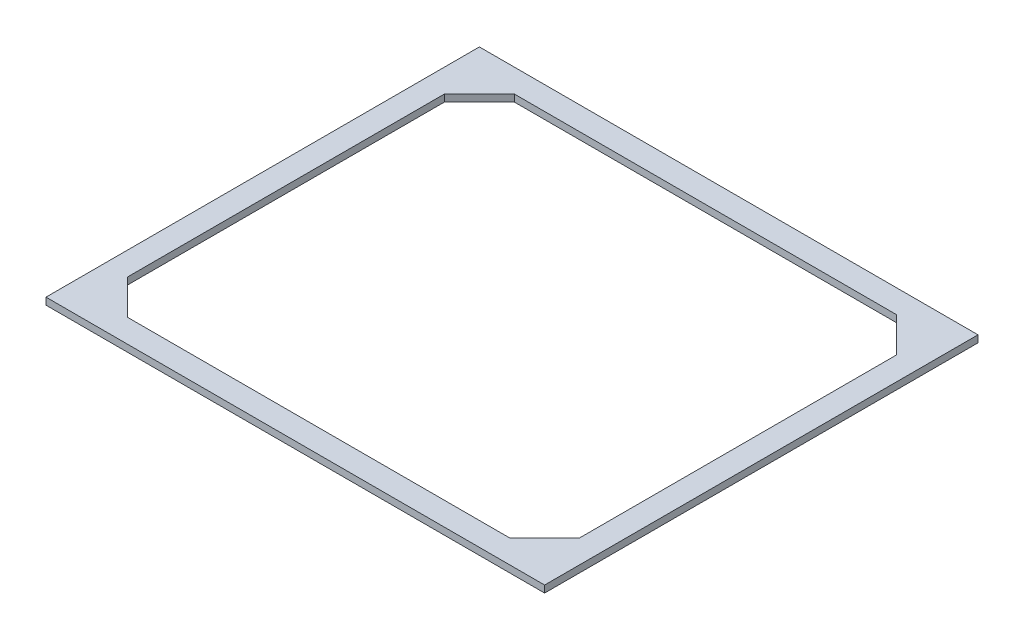
ISO-10303-21;
HEADER;
FILE_DESCRIPTION(('STEP AP214'),'2;1');
FILE_NAME('part.step','',(''),(''),'','','');
FILE_SCHEMA(('AUTOMOTIVE_DESIGN { 1 0 10303 214 1 1 1 1 }'));
ENDSEC;
DATA;
#1=APPLICATION_CONTEXT('core data for automotive mechanical design processes');
#2=APPLICATION_PROTOCOL_DEFINITION('international standard','automotive_design',2000,#1);
#3=PRODUCT_CONTEXT('',#1,'mechanical');
#4=PRODUCT('Part','Part','',(#3));
#5=PRODUCT_RELATED_PRODUCT_CATEGORY('part','',(#4));
#6=PRODUCT_DEFINITION_FORMATION('','',#4);
#7=PRODUCT_DEFINITION_CONTEXT('part definition',#1,'design');
#8=PRODUCT_DEFINITION('design','',#6,#7);
#9=PRODUCT_DEFINITION_SHAPE('','',#8);
#10=(LENGTH_UNIT() NAMED_UNIT(*) SI_UNIT(.MILLI.,.METRE.));
#11=(NAMED_UNIT(*) PLANE_ANGLE_UNIT() SI_UNIT($,.RADIAN.));
#12=(NAMED_UNIT(*) SI_UNIT($,.STERADIAN.) SOLID_ANGLE_UNIT());
#13=UNCERTAINTY_MEASURE_WITH_UNIT(LENGTH_MEASURE(1.E-05),#10,'distance_accuracy_value','');
#14=(GEOMETRIC_REPRESENTATION_CONTEXT(3) GLOBAL_UNCERTAINTY_ASSIGNED_CONTEXT((#13)) GLOBAL_UNIT_ASSIGNED_CONTEXT((#10,
#11,#12)) REPRESENTATION_CONTEXT('',''));
#15=CARTESIAN_POINT('',(0.,0.,0.));
#16=DIRECTION('',(0.,0.,1.));
#17=DIRECTION('',(1.,0.,0.));
#18=AXIS2_PLACEMENT_3D('',#15,#16,#17);
#19=CARTESIAN_POINT('',(0.,3.,0.));
#20=DIRECTION('',(0.,-1.,0.));
#21=DIRECTION('',(0.,0.,-1.));
#22=AXIS2_PLACEMENT_3D('',#19,#20,#21);
#23=PLANE('',#22);
#24=DIRECTION('',(0.,0.,-1.));
#25=VECTOR('',#24,1.);
#26=CARTESIAN_POINT('',(107.,3.,93.));
#27=LINE('',#26,#25);
#28=CARTESIAN_POINT('',(107.,3.,93.));
#29=VERTEX_POINT('',#28);
#30=CARTESIAN_POINT('',(107.,3.,-93.));
#31=VERTEX_POINT('',#30);
#32=EDGE_CURVE('E186',#29,#31,#27,.T.);
#33=ORIENTED_EDGE('',*,*,#32,.T.);
#34=DIRECTION('',(-1.,0.,0.));
#35=VECTOR('',#34,1.);
#36=CARTESIAN_POINT('',(-107.,3.,-93.));
#37=LINE('',#36,#35);
#38=CARTESIAN_POINT('',(-107.,3.,-93.));
#39=VERTEX_POINT('',#38);
#40=EDGE_CURVE('E189',#31,#39,#37,.T.);
#41=ORIENTED_EDGE('',*,*,#40,.T.);
#42=DIRECTION('',(0.,0.,1.));
#43=VECTOR('',#42,1.);
#44=CARTESIAN_POINT('',(-107.,3.,93.));
#45=LINE('',#44,#43);
#46=CARTESIAN_POINT('',(-107.,3.,93.));
#47=VERTEX_POINT('',#46);
#48=EDGE_CURVE('E192',#39,#47,#45,.T.);
#49=ORIENTED_EDGE('',*,*,#48,.T.);
#50=DIRECTION('',(1.,0.,0.));
#51=VECTOR('',#50,1.);
#52=CARTESIAN_POINT('',(-107.,3.,93.));
#53=LINE('',#52,#51);
#54=EDGE_CURVE('E194',#47,#29,#53,.T.);
#55=ORIENTED_EDGE('',*,*,#54,.T.);
#56=EDGE_LOOP('',(#33,#41,#49,#55));
#57=FACE_BOUND('',#56,.T.);
#58=DIRECTION('',(0.707106781186547,0.,-0.707106781186547));
#59=VECTOR('',#58,1.);
#60=CARTESIAN_POINT('',(82.,3.,83.));
#61=LINE('',#60,#59);
#62=CARTESIAN_POINT('',(82.,3.,83.));
#63=VERTEX_POINT('',#62);
#64=CARTESIAN_POINT('',(97.,3.,68.));
#65=VERTEX_POINT('',#64);
#66=EDGE_CURVE('E121',#63,#65,#61,.T.);
#67=ORIENTED_EDGE('',*,*,#66,.F.);
#68=DIRECTION('',(1.,0.,0.));
#69=VECTOR('',#68,1.);
#70=CARTESIAN_POINT('',(-82.,3.,83.));
#71=LINE('',#70,#69);
#72=CARTESIAN_POINT('',(-82.,3.,83.));
#73=VERTEX_POINT('',#72);
#74=EDGE_CURVE('E154',#73,#63,#71,.T.);
#75=ORIENTED_EDGE('',*,*,#74,.F.);
#76=DIRECTION('',(0.707106781186547,0.,0.707106781186547));
#77=VECTOR('',#76,1.);
#78=CARTESIAN_POINT('',(-97.,3.,68.));
#79=LINE('',#78,#77);
#80=CARTESIAN_POINT('',(-97.,3.,68.));
#81=VERTEX_POINT('',#80);
#82=EDGE_CURVE('E152',#81,#73,#79,.T.);
#83=ORIENTED_EDGE('',*,*,#82,.F.);
#84=DIRECTION('',(0.,0.,1.));
#85=VECTOR('',#84,1.);
#86=CARTESIAN_POINT('',(-97.,3.,68.));
#87=LINE('',#86,#85);
#88=CARTESIAN_POINT('',(-97.,3.,-68.));
#89=VERTEX_POINT('',#88);
#90=EDGE_CURVE('E150',#89,#81,#87,.T.);
#91=ORIENTED_EDGE('',*,*,#90,.F.);
#92=DIRECTION('',(-0.707106781186547,0.,0.707106781186547));
#93=VECTOR('',#92,1.);
#94=CARTESIAN_POINT('',(-97.,3.,-68.));
#95=LINE('',#94,#93);
#96=CARTESIAN_POINT('',(-82.,3.,-83.));
#97=VERTEX_POINT('',#96);
#98=EDGE_CURVE('E148',#97,#89,#95,.T.);
#99=ORIENTED_EDGE('',*,*,#98,.F.);
#100=DIRECTION('',(-1.,0.,0.));
#101=VECTOR('',#100,1.);
#102=CARTESIAN_POINT('',(-82.,3.,-83.));
#103=LINE('',#102,#101);
#104=CARTESIAN_POINT('',(82.,3.,-83.));
#105=VERTEX_POINT('',#104);
#106=EDGE_CURVE('E144',#105,#97,#103,.T.);
#107=ORIENTED_EDGE('',*,*,#106,.F.);
#108=DIRECTION('',(-0.707106781186547,0.,-0.707106781186547));
#109=VECTOR('',#108,1.);
#110=CARTESIAN_POINT('',(82.,3.,-83.));
#111=LINE('',#110,#109);
#112=CARTESIAN_POINT('',(97.,3.,-68.));
#113=VERTEX_POINT('',#112);
#114=EDGE_CURVE('E142',#113,#105,#111,.T.);
#115=ORIENTED_EDGE('',*,*,#114,.F.);
#116=DIRECTION('',(0.,0.,-1.));
#117=VECTOR('',#116,1.);
#118=CARTESIAN_POINT('',(97.,3.,68.));
#119=LINE('',#118,#117);
#120=EDGE_CURVE('E129',#65,#113,#119,.T.);
#121=ORIENTED_EDGE('',*,*,#120,.F.);
#122=EDGE_LOOP('',(#67,#75,#83,#91,#99,#107,#115,#121));
#123=FACE_BOUND('',#122,.T.);
#124=ADVANCED_FACE('F32',(#57,#123),#23,.F.);
#125=CARTESIAN_POINT('',(0.,0.,0.));
#126=DIRECTION('',(0.,-1.,0.));
#127=DIRECTION('',(0.,0.,-1.));
#128=AXIS2_PLACEMENT_3D('',#125,#126,#127);
#129=PLANE('',#128);
#130=DIRECTION('',(0.,0.,-1.));
#131=VECTOR('',#130,1.);
#132=CARTESIAN_POINT('',(107.,0.,93.));
#133=LINE('',#132,#131);
#134=CARTESIAN_POINT('',(107.,0.,93.));
#135=VERTEX_POINT('',#134);
#136=CARTESIAN_POINT('',(107.,0.,-93.));
#137=VERTEX_POINT('',#136);
#138=EDGE_CURVE('E137',#135,#137,#133,.T.);
#139=ORIENTED_EDGE('',*,*,#138,.F.);
#140=DIRECTION('',(1.,0.,0.));
#141=VECTOR('',#140,1.);
#142=CARTESIAN_POINT('',(-107.,0.,93.));
#143=LINE('',#142,#141);
#144=CARTESIAN_POINT('',(-107.,0.,93.));
#145=VERTEX_POINT('',#144);
#146=EDGE_CURVE('E190',#145,#135,#143,.T.);
#147=ORIENTED_EDGE('',*,*,#146,.F.);
#148=DIRECTION('',(0.,0.,1.));
#149=VECTOR('',#148,1.);
#150=CARTESIAN_POINT('',(-107.,0.,93.));
#151=LINE('',#150,#149);
#152=CARTESIAN_POINT('',(-107.,0.,-93.));
#153=VERTEX_POINT('',#152);
#154=EDGE_CURVE('E201',#153,#145,#151,.T.);
#155=ORIENTED_EDGE('',*,*,#154,.F.);
#156=DIRECTION('',(-1.,0.,0.));
#157=VECTOR('',#156,1.);
#158=CARTESIAN_POINT('',(-107.,0.,-93.));
#159=LINE('',#158,#157);
#160=EDGE_CURVE('E199',#137,#153,#159,.T.);
#161=ORIENTED_EDGE('',*,*,#160,.F.);
#162=EDGE_LOOP('',(#139,#147,#155,#161));
#163=FACE_BOUND('',#162,.T.);
#164=DIRECTION('',(1.,0.,0.));
#165=VECTOR('',#164,1.);
#166=CARTESIAN_POINT('',(-82.,0.,83.));
#167=LINE('',#166,#165);
#168=CARTESIAN_POINT('',(-82.,0.,83.));
#169=VERTEX_POINT('',#168);
#170=CARTESIAN_POINT('',(82.,0.,83.));
#171=VERTEX_POINT('',#170);
#172=EDGE_CURVE('E130',#169,#171,#167,.T.);
#173=ORIENTED_EDGE('',*,*,#172,.T.);
#174=DIRECTION('',(0.707106781186547,0.,-0.707106781186547));
#175=VECTOR('',#174,1.);
#176=CARTESIAN_POINT('',(82.,0.,83.));
#177=LINE('',#176,#175);
#178=CARTESIAN_POINT('',(97.,0.,68.));
#179=VERTEX_POINT('',#178);
#180=EDGE_CURVE('E55',#171,#179,#177,.T.);
#181=ORIENTED_EDGE('',*,*,#180,.T.);
#182=DIRECTION('',(0.,0.,-1.));
#183=VECTOR('',#182,1.);
#184=CARTESIAN_POINT('',(97.,0.,68.));
#185=LINE('',#184,#183);
#186=CARTESIAN_POINT('',(97.,0.,-68.));
#187=VERTEX_POINT('',#186);
#188=EDGE_CURVE('E136',#179,#187,#185,.T.);
#189=ORIENTED_EDGE('',*,*,#188,.T.);
#190=DIRECTION('',(-0.707106781186547,0.,-0.707106781186547));
#191=VECTOR('',#190,1.);
#192=CARTESIAN_POINT('',(82.,0.,-83.));
#193=LINE('',#192,#191);
#194=CARTESIAN_POINT('',(82.,0.,-83.));
#195=VERTEX_POINT('',#194);
#196=EDGE_CURVE('E158',#187,#195,#193,.T.);
#197=ORIENTED_EDGE('',*,*,#196,.T.);
#198=DIRECTION('',(-1.,0.,0.));
#199=VECTOR('',#198,1.);
#200=CARTESIAN_POINT('',(-82.,0.,-83.));
#201=LINE('',#200,#199);
#202=CARTESIAN_POINT('',(-82.,0.,-83.));
#203=VERTEX_POINT('',#202);
#204=EDGE_CURVE('E161',#195,#203,#201,.T.);
#205=ORIENTED_EDGE('',*,*,#204,.T.);
#206=DIRECTION('',(-0.707106781186547,0.,0.707106781186547));
#207=VECTOR('',#206,1.);
#208=CARTESIAN_POINT('',(-97.,0.,-68.));
#209=LINE('',#208,#207);
#210=CARTESIAN_POINT('',(-97.,0.,-68.));
#211=VERTEX_POINT('',#210);
#212=EDGE_CURVE('E164',#203,#211,#209,.T.);
#213=ORIENTED_EDGE('',*,*,#212,.T.);
#214=DIRECTION('',(0.,0.,1.));
#215=VECTOR('',#214,1.);
#216=CARTESIAN_POINT('',(-97.,0.,68.));
#217=LINE('',#216,#215);
#218=CARTESIAN_POINT('',(-97.,0.,68.));
#219=VERTEX_POINT('',#218);
#220=EDGE_CURVE('E167',#211,#219,#217,.T.);
#221=ORIENTED_EDGE('',*,*,#220,.T.);
#222=DIRECTION('',(0.707106781186547,0.,0.707106781186547));
#223=VECTOR('',#222,1.);
#224=CARTESIAN_POINT('',(-97.,0.,68.));
#225=LINE('',#224,#223);
#226=EDGE_CURVE('E170',#219,#169,#225,.T.);
#227=ORIENTED_EDGE('',*,*,#226,.T.);
#228=EDGE_LOOP('',(#173,#181,#189,#197,#205,#213,#221,#227));
#229=FACE_BOUND('',#228,.T.);
#230=ADVANCED_FACE('F219',(#163,#229),#129,.T.);
#231=CARTESIAN_POINT('',(107.,3.,93.));
#232=DIRECTION('',(-1.,0.,0.));
#233=DIRECTION('',(0.,0.,1.));
#234=AXIS2_PLACEMENT_3D('',#231,#232,#233);
#235=PLANE('',#234);
#236=ORIENTED_EDGE('',*,*,#138,.T.);
#237=DIRECTION('',(0.,-1.,0.));
#238=VECTOR('',#237,1.);
#239=CARTESIAN_POINT('',(107.,3.,-93.));
#240=LINE('',#239,#238);
#241=EDGE_CURVE('E11',#31,#137,#240,.T.);
#242=ORIENTED_EDGE('',*,*,#241,.F.);
#243=ORIENTED_EDGE('',*,*,#32,.F.);
#244=DIRECTION('',(0.,-1.,0.));
#245=VECTOR('',#244,1.);
#246=CARTESIAN_POINT('',(107.,3.,93.));
#247=LINE('',#246,#245);
#248=EDGE_CURVE('E196',#29,#135,#247,.T.);
#249=ORIENTED_EDGE('',*,*,#248,.T.);
#250=EDGE_LOOP('',(#236,#242,#243,#249));
#251=FACE_BOUND('',#250,.T.);
#252=ADVANCED_FACE('F34',(#251),#235,.F.);
#253=CARTESIAN_POINT('',(-107.,3.,-93.));
#254=DIRECTION('',(0.,0.,1.));
#255=DIRECTION('',(1.,0.,0.));
#256=AXIS2_PLACEMENT_3D('',#253,#254,#255);
#257=PLANE('',#256);
#258=ORIENTED_EDGE('',*,*,#160,.T.);
#259=DIRECTION('',(0.,-1.,0.));
#260=VECTOR('',#259,1.);
#261=CARTESIAN_POINT('',(-107.,3.,-93.));
#262=LINE('',#261,#260);
#263=EDGE_CURVE('E40',#39,#153,#262,.T.);
#264=ORIENTED_EDGE('',*,*,#263,.F.);
#265=ORIENTED_EDGE('',*,*,#40,.F.);
#266=ORIENTED_EDGE('',*,*,#241,.T.);
#267=EDGE_LOOP('',(#258,#264,#265,#266));
#268=FACE_BOUND('',#267,.T.);
#269=ADVANCED_FACE('F229',(#268),#257,.F.);
#270=CARTESIAN_POINT('',(-107.,3.,93.));
#271=DIRECTION('',(1.,0.,0.));
#272=DIRECTION('',(0.,0.,-1.));
#273=AXIS2_PLACEMENT_3D('',#270,#271,#272);
#274=PLANE('',#273);
#275=ORIENTED_EDGE('',*,*,#154,.T.);
#276=DIRECTION('',(0.,-1.,0.));
#277=VECTOR('',#276,1.);
#278=CARTESIAN_POINT('',(-107.,3.,93.));
#279=LINE('',#278,#277);
#280=EDGE_CURVE('E206',#47,#145,#279,.T.);
#281=ORIENTED_EDGE('',*,*,#280,.F.);
#282=ORIENTED_EDGE('',*,*,#48,.F.);
#283=ORIENTED_EDGE('',*,*,#263,.T.);
#284=EDGE_LOOP('',(#275,#281,#282,#283));
#285=FACE_BOUND('',#284,.T.);
#286=ADVANCED_FACE('F213',(#285),#274,.F.);
#287=CARTESIAN_POINT('',(-107.,3.,93.));
#288=DIRECTION('',(0.,0.,-1.));
#289=DIRECTION('',(-1.,0.,0.));
#290=AXIS2_PLACEMENT_3D('',#287,#288,#289);
#291=PLANE('',#290);
#292=ORIENTED_EDGE('',*,*,#146,.T.);
#293=ORIENTED_EDGE('',*,*,#248,.F.);
#294=ORIENTED_EDGE('',*,*,#54,.F.);
#295=ORIENTED_EDGE('',*,*,#280,.T.);
#296=EDGE_LOOP('',(#292,#293,#294,#295));
#297=FACE_BOUND('',#296,.T.);
#298=ADVANCED_FACE('F223',(#297),#291,.F.);
#299=CARTESIAN_POINT('',(82.,3.,83.));
#300=DIRECTION('',(-0.707106781186548,0.,-0.707106781186548));
#301=DIRECTION('',(-0.707106781186548,0.,0.707106781186548));
#302=AXIS2_PLACEMENT_3D('',#299,#300,#301);
#303=PLANE('',#302);
#304=ORIENTED_EDGE('',*,*,#180,.F.);
#305=DIRECTION('',(0.,-1.,0.));
#306=VECTOR('',#305,1.);
#307=CARTESIAN_POINT('',(82.,3.,83.));
#308=LINE('',#307,#306);
#309=EDGE_CURVE('E125',#63,#171,#308,.T.);
#310=ORIENTED_EDGE('',*,*,#309,.F.);
#311=ORIENTED_EDGE('',*,*,#66,.T.);
#312=DIRECTION('',(0.,-1.,0.));
#313=VECTOR('',#312,1.);
#314=CARTESIAN_POINT('',(97.,3.,68.));
#315=LINE('',#314,#313);
#316=EDGE_CURVE('E124',#65,#179,#315,.T.);
#317=ORIENTED_EDGE('',*,*,#316,.T.);
#318=EDGE_LOOP('',(#304,#310,#311,#317));
#319=FACE_BOUND('',#318,.T.);
#320=ADVANCED_FACE('F123',(#319),#303,.T.);
#321=CARTESIAN_POINT('',(97.,3.,68.));
#322=DIRECTION('',(-1.,0.,0.));
#323=DIRECTION('',(0.,0.,1.));
#324=AXIS2_PLACEMENT_3D('',#321,#322,#323);
#325=PLANE('',#324);
#326=ORIENTED_EDGE('',*,*,#188,.F.);
#327=ORIENTED_EDGE('',*,*,#316,.F.);
#328=ORIENTED_EDGE('',*,*,#120,.T.);
#329=DIRECTION('',(0.,-1.,0.));
#330=VECTOR('',#329,1.);
#331=CARTESIAN_POINT('',(97.,3.,-68.));
#332=LINE('',#331,#330);
#333=EDGE_CURVE('E138',#113,#187,#332,.T.);
#334=ORIENTED_EDGE('',*,*,#333,.T.);
#335=EDGE_LOOP('',(#326,#327,#328,#334));
#336=FACE_BOUND('',#335,.T.);
#337=ADVANCED_FACE('F133',(#336),#325,.T.);
#338=CARTESIAN_POINT('',(82.,3.,-83.));
#339=DIRECTION('',(-0.707106781186548,0.,0.707106781186548));
#340=DIRECTION('',(0.707106781186548,0.,0.707106781186548));
#341=AXIS2_PLACEMENT_3D('',#338,#339,#340);
#342=PLANE('',#341);
#343=ORIENTED_EDGE('',*,*,#196,.F.);
#344=ORIENTED_EDGE('',*,*,#333,.F.);
#345=ORIENTED_EDGE('',*,*,#114,.T.);
#346=DIRECTION('',(0.,-1.,0.));
#347=VECTOR('',#346,1.);
#348=CARTESIAN_POINT('',(82.,3.,-83.));
#349=LINE('',#348,#347);
#350=EDGE_CURVE('E183',#105,#195,#349,.T.);
#351=ORIENTED_EDGE('',*,*,#350,.T.);
#352=EDGE_LOOP('',(#343,#344,#345,#351));
#353=FACE_BOUND('',#352,.T.);
#354=ADVANCED_FACE('F252',(#353),#342,.T.);
#355=CARTESIAN_POINT('',(-82.,3.,-83.));
#356=DIRECTION('',(0.,0.,1.));
#357=DIRECTION('',(1.,0.,0.));
#358=AXIS2_PLACEMENT_3D('',#355,#356,#357);
#359=PLANE('',#358);
#360=ORIENTED_EDGE('',*,*,#204,.F.);
#361=ORIENTED_EDGE('',*,*,#350,.F.);
#362=ORIENTED_EDGE('',*,*,#106,.T.);
#363=DIRECTION('',(0.,-1.,0.));
#364=VECTOR('',#363,1.);
#365=CARTESIAN_POINT('',(-82.,3.,-83.));
#366=LINE('',#365,#364);
#367=EDGE_CURVE('E181',#97,#203,#366,.T.);
#368=ORIENTED_EDGE('',*,*,#367,.T.);
#369=EDGE_LOOP('',(#360,#361,#362,#368));
#370=FACE_BOUND('',#369,.T.);
#371=ADVANCED_FACE('F256',(#370),#359,.T.);
#372=CARTESIAN_POINT('',(-97.,3.,-68.));
#373=DIRECTION('',(0.707106781186548,0.,0.707106781186548));
#374=DIRECTION('',(0.707106781186548,0.,-0.707106781186548));
#375=AXIS2_PLACEMENT_3D('',#372,#373,#374);
#376=PLANE('',#375);
#377=ORIENTED_EDGE('',*,*,#212,.F.);
#378=ORIENTED_EDGE('',*,*,#367,.F.);
#379=ORIENTED_EDGE('',*,*,#98,.T.);
#380=DIRECTION('',(0.,-1.,0.));
#381=VECTOR('',#380,1.);
#382=CARTESIAN_POINT('',(-97.,3.,-68.));
#383=LINE('',#382,#381);
#384=EDGE_CURVE('E179',#89,#211,#383,.T.);
#385=ORIENTED_EDGE('',*,*,#384,.T.);
#386=EDGE_LOOP('',(#377,#378,#379,#385));
#387=FACE_BOUND('',#386,.T.);
#388=ADVANCED_FACE('F262',(#387),#376,.T.);
#389=CARTESIAN_POINT('',(-97.,3.,68.));
#390=DIRECTION('',(1.,0.,0.));
#391=DIRECTION('',(0.,0.,-1.));
#392=AXIS2_PLACEMENT_3D('',#389,#390,#391);
#393=PLANE('',#392);
#394=ORIENTED_EDGE('',*,*,#220,.F.);
#395=ORIENTED_EDGE('',*,*,#384,.F.);
#396=ORIENTED_EDGE('',*,*,#90,.T.);
#397=DIRECTION('',(0.,-1.,0.));
#398=VECTOR('',#397,1.);
#399=CARTESIAN_POINT('',(-97.,3.,68.));
#400=LINE('',#399,#398);
#401=EDGE_CURVE('E177',#81,#219,#400,.T.);
#402=ORIENTED_EDGE('',*,*,#401,.T.);
#403=EDGE_LOOP('',(#394,#395,#396,#402));
#404=FACE_BOUND('',#403,.T.);
#405=ADVANCED_FACE('F266',(#404),#393,.T.);
#406=CARTESIAN_POINT('',(-97.,3.,68.));
#407=DIRECTION('',(0.707106781186548,0.,-0.707106781186548));
#408=DIRECTION('',(-0.707106781186548,0.,-0.707106781186548));
#409=AXIS2_PLACEMENT_3D('',#406,#407,#408);
#410=PLANE('',#409);
#411=ORIENTED_EDGE('',*,*,#226,.F.);
#412=ORIENTED_EDGE('',*,*,#401,.F.);
#413=ORIENTED_EDGE('',*,*,#82,.T.);
#414=DIRECTION('',(0.,-1.,0.));
#415=VECTOR('',#414,1.);
#416=CARTESIAN_POINT('',(-82.,3.,83.));
#417=LINE('',#416,#415);
#418=EDGE_CURVE('E47',#73,#169,#417,.T.);
#419=ORIENTED_EDGE('',*,*,#418,.T.);
#420=EDGE_LOOP('',(#411,#412,#413,#419));
#421=FACE_BOUND('',#420,.T.);
#422=ADVANCED_FACE('F270',(#421),#410,.T.);
#423=CARTESIAN_POINT('',(-82.,3.,83.));
#424=DIRECTION('',(0.,0.,-1.));
#425=DIRECTION('',(-1.,0.,0.));
#426=AXIS2_PLACEMENT_3D('',#423,#424,#425);
#427=PLANE('',#426);
#428=ORIENTED_EDGE('',*,*,#172,.F.);
#429=ORIENTED_EDGE('',*,*,#418,.F.);
#430=ORIENTED_EDGE('',*,*,#74,.T.);
#431=ORIENTED_EDGE('',*,*,#309,.T.);
#432=EDGE_LOOP('',(#428,#429,#430,#431));
#433=FACE_BOUND('',#432,.T.);
#434=ADVANCED_FACE('F274',(#433),#427,.T.);
#435=CLOSED_SHELL('',(#124,#230,#252,#269,#286,#298,#320,#337,#354,#371,#388,#405,#422,#434));
#436=MANIFOLD_SOLID_BREP('B2',#435);
#437=ADVANCED_BREP_SHAPE_REPRESENTATION('',(#18,#436),#14);
#438=SHAPE_DEFINITION_REPRESENTATION(#9,#437);
ENDSEC;
END-ISO-10303-21;
